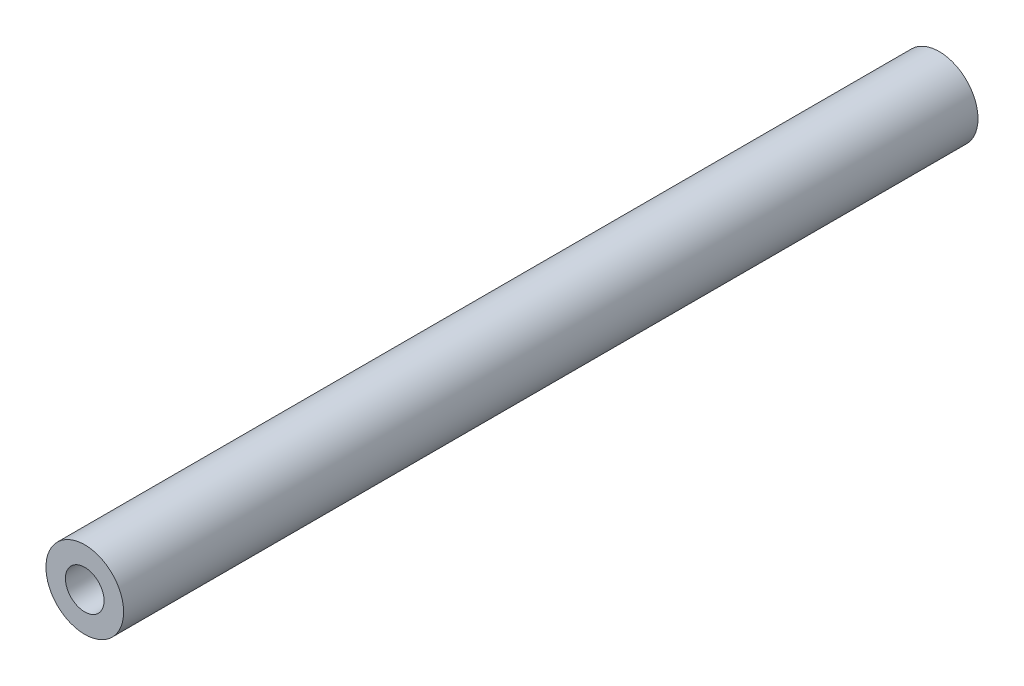
ISO-10303-21;
HEADER;
FILE_DESCRIPTION(('STEP AP214'),'2;1');
FILE_NAME('part.step','',(''),(''),'','','');
FILE_SCHEMA(('AUTOMOTIVE_DESIGN { 1 0 10303 214 1 1 1 1 }'));
ENDSEC;
DATA;
#1=APPLICATION_CONTEXT('core data for automotive mechanical design processes');
#2=APPLICATION_PROTOCOL_DEFINITION('international standard','automotive_design',2000,#1);
#3=PRODUCT_CONTEXT('',#1,'mechanical');
#4=PRODUCT('Part','Part','',(#3));
#5=PRODUCT_RELATED_PRODUCT_CATEGORY('part','',(#4));
#6=PRODUCT_DEFINITION_FORMATION('','',#4);
#7=PRODUCT_DEFINITION_CONTEXT('part definition',#1,'design');
#8=PRODUCT_DEFINITION('design','',#6,#7);
#9=PRODUCT_DEFINITION_SHAPE('','',#8);
#10=(LENGTH_UNIT() NAMED_UNIT(*) SI_UNIT(.MILLI.,.METRE.));
#11=(NAMED_UNIT(*) PLANE_ANGLE_UNIT() SI_UNIT($,.RADIAN.));
#12=(NAMED_UNIT(*) SI_UNIT($,.STERADIAN.) SOLID_ANGLE_UNIT());
#13=UNCERTAINTY_MEASURE_WITH_UNIT(LENGTH_MEASURE(1.E-05),#10,'distance_accuracy_value','');
#14=(GEOMETRIC_REPRESENTATION_CONTEXT(3) GLOBAL_UNCERTAINTY_ASSIGNED_CONTEXT((#13)) GLOBAL_UNIT_ASSIGNED_CONTEXT((#10,
#11,#12)) REPRESENTATION_CONTEXT('',''));
#15=CARTESIAN_POINT('',(0.,0.,0.));
#16=DIRECTION('',(0.,0.,1.));
#17=DIRECTION('',(1.,0.,0.));
#18=AXIS2_PLACEMENT_3D('',#15,#16,#17);
#19=CARTESIAN_POINT('',(0.,0.,558.8));
#20=DIRECTION('',(0.,0.,1.));
#21=DIRECTION('',(1.,0.,0.));
#22=AXIS2_PLACEMENT_3D('',#19,#20,#21);
#23=PLANE('',#22);
#24=CARTESIAN_POINT('',(0.,0.,558.8));
#25=DIRECTION('',(0.,0.,1.));
#26=DIRECTION('',(1.,0.,0.));
#27=AXIS2_PLACEMENT_3D('',#24,#25,#26);
#28=CIRCLE('',#27,25.3947307321489);
#29=CARTESIAN_POINT('',(25.3947307321489,0.,558.8));
#30=VERTEX_POINT('',#29);
#31=EDGE_CURVE('E10',#30,#30,#28,.T.);
#32=ORIENTED_EDGE('',*,*,#31,.T.);
#33=EDGE_LOOP('',(#32));
#34=FACE_BOUND('',#33,.T.);
#35=CARTESIAN_POINT('',(0.,0.,558.8));
#36=DIRECTION('',(0.,0.,1.));
#37=DIRECTION('',(1.,0.,0.));
#38=AXIS2_PLACEMENT_3D('',#35,#36,#37);
#39=CIRCLE('',#38,12.638507993661);
#40=CARTESIAN_POINT('',(12.638507993661,0.,558.8));
#41=VERTEX_POINT('',#40);
#42=EDGE_CURVE('E50',#41,#41,#39,.T.);
#43=ORIENTED_EDGE('',*,*,#42,.F.);
#44=EDGE_LOOP('',(#43));
#45=FACE_BOUND('',#44,.T.);
#46=ADVANCED_FACE('F37',(#34,#45),#23,.T.);
#47=CARTESIAN_POINT('',(0.,0.,0.));
#48=DIRECTION('',(0.,0.,1.));
#49=DIRECTION('',(1.,0.,0.));
#50=AXIS2_PLACEMENT_3D('',#47,#48,#49);
#51=PLANE('',#50);
#52=CARTESIAN_POINT('',(0.,0.,0.));
#53=DIRECTION('',(0.,0.,1.));
#54=DIRECTION('',(1.,0.,0.));
#55=AXIS2_PLACEMENT_3D('',#52,#53,#54);
#56=CIRCLE('',#55,25.3947307321489);
#57=CARTESIAN_POINT('',(25.3947307321489,0.,0.));
#58=VERTEX_POINT('',#57);
#59=EDGE_CURVE('E41',#58,#58,#56,.T.);
#60=ORIENTED_EDGE('',*,*,#59,.F.);
#61=EDGE_LOOP('',(#60));
#62=FACE_BOUND('',#61,.T.);
#63=CARTESIAN_POINT('',(0.,0.,0.));
#64=DIRECTION('',(0.,0.,1.));
#65=DIRECTION('',(1.,0.,0.));
#66=AXIS2_PLACEMENT_3D('',#63,#64,#65);
#67=CIRCLE('',#66,12.638507993661);
#68=CARTESIAN_POINT('',(12.638507993661,0.,0.));
#69=VERTEX_POINT('',#68);
#70=EDGE_CURVE('E52',#69,#69,#67,.T.);
#71=ORIENTED_EDGE('',*,*,#70,.T.);
#72=EDGE_LOOP('',(#71));
#73=FACE_BOUND('',#72,.T.);
#74=ADVANCED_FACE('F64',(#62,#73),#51,.F.);
#75=CARTESIAN_POINT('',(0.,0.,558.8));
#76=DIRECTION('',(0.,0.,-1.));
#77=DIRECTION('',(-1.,0.,0.));
#78=AXIS2_PLACEMENT_3D('',#75,#76,#77);
#79=CYLINDRICAL_SURFACE('',#78,25.3947307321489);
#80=ORIENTED_EDGE('',*,*,#31,.F.);
#81=EDGE_LOOP('',(#80));
#82=FACE_BOUND('',#81,.T.);
#83=ORIENTED_EDGE('',*,*,#59,.T.);
#84=EDGE_LOOP('',(#83));
#85=FACE_BOUND('',#84,.T.);
#86=ADVANCED_FACE('F39',(#82,#85),#79,.T.);
#87=CARTESIAN_POINT('',(0.,0.,558.8));
#88=DIRECTION('',(0.,0.,-1.));
#89=DIRECTION('',(-1.,0.,0.));
#90=AXIS2_PLACEMENT_3D('',#87,#88,#89);
#91=CYLINDRICAL_SURFACE('',#90,12.638507993661);
#92=ORIENTED_EDGE('',*,*,#42,.T.);
#93=EDGE_LOOP('',(#92));
#94=FACE_BOUND('',#93,.T.);
#95=ORIENTED_EDGE('',*,*,#70,.F.);
#96=EDGE_LOOP('',(#95));
#97=FACE_BOUND('',#96,.T.);
#98=ADVANCED_FACE('F60',(#94,#97),#91,.F.);
#99=CLOSED_SHELL('',(#46,#74,#86,#98));
#100=MANIFOLD_SOLID_BREP('B2',#99);
#101=ADVANCED_BREP_SHAPE_REPRESENTATION('',(#18,#100),#14);
#102=SHAPE_DEFINITION_REPRESENTATION(#9,#101);
ENDSEC;
END-ISO-10303-21;
